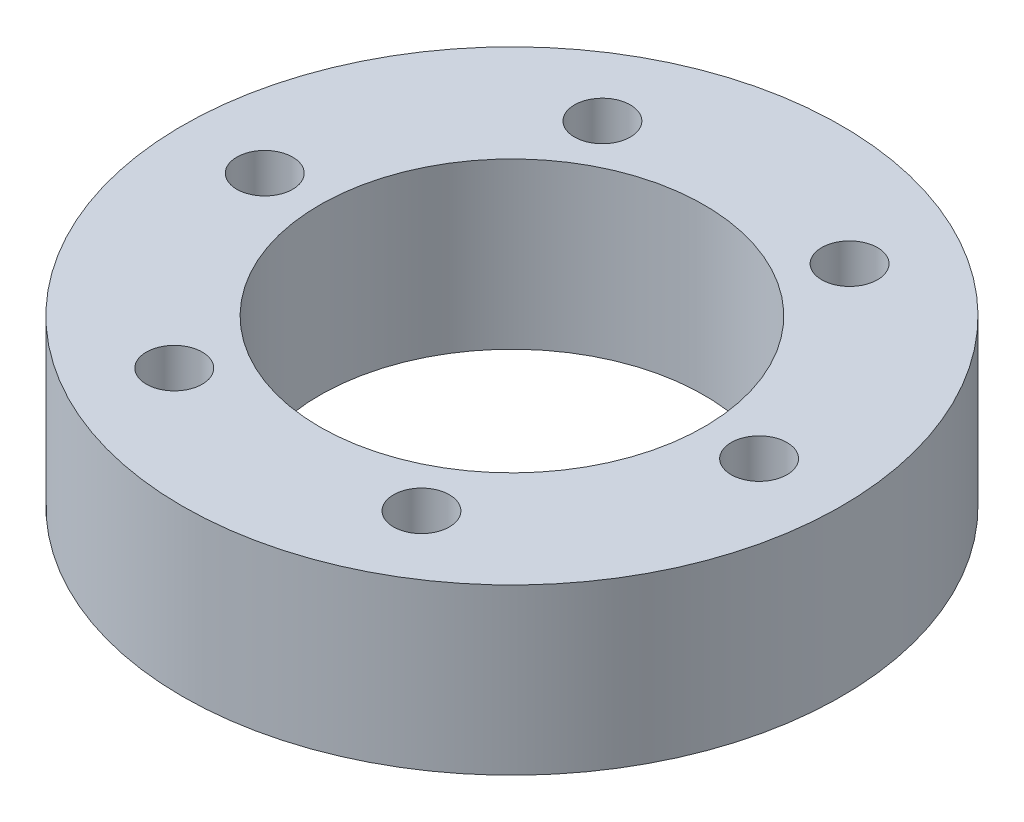
ISO-10303-21;
HEADER;
FILE_DESCRIPTION(('STEP AP214'),'2;1');
FILE_NAME('part.step','',(''),(''),'','','');
FILE_SCHEMA(('AUTOMOTIVE_DESIGN { 1 0 10303 214 1 1 1 1 }'));
ENDSEC;
DATA;
#1=APPLICATION_CONTEXT('core data for automotive mechanical design processes');
#2=APPLICATION_PROTOCOL_DEFINITION('international standard','automotive_design',2000,#1);
#3=PRODUCT_CONTEXT('',#1,'mechanical');
#4=PRODUCT('Part','Part','',(#3));
#5=PRODUCT_RELATED_PRODUCT_CATEGORY('part','',(#4));
#6=PRODUCT_DEFINITION_FORMATION('','',#4);
#7=PRODUCT_DEFINITION_CONTEXT('part definition',#1,'design');
#8=PRODUCT_DEFINITION('design','',#6,#7);
#9=PRODUCT_DEFINITION_SHAPE('','',#8);
#10=(LENGTH_UNIT() NAMED_UNIT(*) SI_UNIT(.MILLI.,.METRE.));
#11=(NAMED_UNIT(*) PLANE_ANGLE_UNIT() SI_UNIT($,.RADIAN.));
#12=(NAMED_UNIT(*) SI_UNIT($,.STERADIAN.) SOLID_ANGLE_UNIT());
#13=UNCERTAINTY_MEASURE_WITH_UNIT(LENGTH_MEASURE(1.E-05),#10,'distance_accuracy_value','');
#14=(GEOMETRIC_REPRESENTATION_CONTEXT(3) GLOBAL_UNCERTAINTY_ASSIGNED_CONTEXT((#13)) GLOBAL_UNIT_ASSIGNED_CONTEXT((#10,
#11,#12)) REPRESENTATION_CONTEXT('',''));
#15=CARTESIAN_POINT('',(0.,0.,0.));
#16=DIRECTION('',(0.,0.,1.));
#17=DIRECTION('',(1.,0.,0.));
#18=AXIS2_PLACEMENT_3D('',#15,#16,#17);
#19=CARTESIAN_POINT('',(0.,9.,0.));
#20=DIRECTION('',(0.,-1.,0.));
#21=DIRECTION('',(0.,0.,-1.));
#22=AXIS2_PLACEMENT_3D('',#19,#20,#21);
#23=CYLINDRICAL_SURFACE('',#22,18.);
#24=CARTESIAN_POINT('',(0.,9.,0.));
#25=DIRECTION('',(0.,1.,0.));
#26=DIRECTION('',(0.,0.,1.));
#27=AXIS2_PLACEMENT_3D('',#24,#25,#26);
#28=CIRCLE('',#27,18.);
#29=CARTESIAN_POINT('',(0.,9.,18.));
#30=VERTEX_POINT('',#29);
#31=EDGE_CURVE('E10',#30,#30,#28,.T.);
#32=ORIENTED_EDGE('',*,*,#31,.F.);
#33=EDGE_LOOP('',(#32));
#34=FACE_BOUND('',#33,.T.);
#35=CARTESIAN_POINT('',(0.,0.,0.));
#36=DIRECTION('',(0.,1.,0.));
#37=DIRECTION('',(0.,0.,1.));
#38=AXIS2_PLACEMENT_3D('',#35,#36,#37);
#39=CIRCLE('',#38,18.);
#40=CARTESIAN_POINT('',(0.,0.,18.));
#41=VERTEX_POINT('',#40);
#42=EDGE_CURVE('E43',#41,#41,#39,.T.);
#43=ORIENTED_EDGE('',*,*,#42,.T.);
#44=EDGE_LOOP('',(#43));
#45=FACE_BOUND('',#44,.T.);
#46=ADVANCED_FACE('F40',(#34,#45),#23,.T.);
#47=CARTESIAN_POINT('',(0.,9.,0.));
#48=DIRECTION('',(0.,1.,0.));
#49=DIRECTION('',(0.,0.,1.));
#50=AXIS2_PLACEMENT_3D('',#47,#48,#49);
#51=PLANE('',#50);
#52=CARTESIAN_POINT('',(0.,9.,0.));
#53=DIRECTION('',(0.,1.,0.));
#54=DIRECTION('',(0.,0.,1.));
#55=AXIS2_PLACEMENT_3D('',#52,#53,#54);
#56=CIRCLE('',#55,10.5);
#57=CARTESIAN_POINT('',(0.,9.,10.5));
#58=VERTEX_POINT('',#57);
#59=EDGE_CURVE('E102',#58,#58,#56,.T.);
#60=ORIENTED_EDGE('',*,*,#59,.F.);
#61=EDGE_LOOP('',(#60));
#62=FACE_BOUND('',#61,.T.);
#63=CARTESIAN_POINT('',(13.5,9.,0.));
#64=DIRECTION('',(0.,1.,0.));
#65=DIRECTION('',(0.,0.,1.));
#66=AXIS2_PLACEMENT_3D('',#63,#64,#65);
#67=CIRCLE('',#66,1.525);
#68=CARTESIAN_POINT('',(13.5,9.,1.525));
#69=VERTEX_POINT('',#68);
#70=EDGE_CURVE('E87',#69,#69,#67,.T.);
#71=ORIENTED_EDGE('',*,*,#70,.F.);
#72=EDGE_LOOP('',(#71));
#73=FACE_BOUND('',#72,.T.);
#74=CARTESIAN_POINT('',(6.75,9.,-11.6913429510899));
#75=DIRECTION('',(0.,1.,0.));
#76=DIRECTION('',(0.,0.,1.));
#77=AXIS2_PLACEMENT_3D('',#74,#75,#76);
#78=CIRCLE('',#77,1.525);
#79=CARTESIAN_POINT('',(6.75,9.,-10.1663429510899));
#80=VERTEX_POINT('',#79);
#81=EDGE_CURVE('E59',#80,#80,#78,.T.);
#82=ORIENTED_EDGE('',*,*,#81,.F.);
#83=EDGE_LOOP('',(#82));
#84=FACE_BOUND('',#83,.T.);
#85=CARTESIAN_POINT('',(-6.75000000000001,9.,-11.6913429510899));
#86=DIRECTION('',(0.,1.,0.));
#87=DIRECTION('',(0.,0.,1.));
#88=AXIS2_PLACEMENT_3D('',#85,#86,#87);
#89=CIRCLE('',#88,1.525);
#90=CARTESIAN_POINT('',(-6.75000000000001,9.,-10.1663429510899));
#91=VERTEX_POINT('',#90);
#92=EDGE_CURVE('E58',#91,#91,#89,.T.);
#93=ORIENTED_EDGE('',*,*,#92,.F.);
#94=EDGE_LOOP('',(#93));
#95=FACE_BOUND('',#94,.T.);
#96=CARTESIAN_POINT('',(-13.5,9.,0.));
#97=DIRECTION('',(0.,1.,0.));
#98=DIRECTION('',(0.,0.,1.));
#99=AXIS2_PLACEMENT_3D('',#96,#97,#98);
#100=CIRCLE('',#99,1.525);
#101=CARTESIAN_POINT('',(-13.5,9.,1.525));
#102=VERTEX_POINT('',#101);
#103=EDGE_CURVE('E67',#102,#102,#100,.T.);
#104=ORIENTED_EDGE('',*,*,#103,.F.);
#105=EDGE_LOOP('',(#104));
#106=FACE_BOUND('',#105,.T.);
#107=CARTESIAN_POINT('',(-6.75,9.,11.6913429510899));
#108=DIRECTION('',(0.,1.,0.));
#109=DIRECTION('',(0.,0.,1.));
#110=AXIS2_PLACEMENT_3D('',#107,#108,#109);
#111=CIRCLE('',#110,1.525);
#112=CARTESIAN_POINT('',(-6.75,9.,13.2163429510899));
#113=VERTEX_POINT('',#112);
#114=EDGE_CURVE('E75',#113,#113,#111,.T.);
#115=ORIENTED_EDGE('',*,*,#114,.F.);
#116=EDGE_LOOP('',(#115));
#117=FACE_BOUND('',#116,.T.);
#118=CARTESIAN_POINT('',(6.75,9.,11.6913429510899));
#119=DIRECTION('',(0.,1.,0.));
#120=DIRECTION('',(0.,0.,1.));
#121=AXIS2_PLACEMENT_3D('',#118,#119,#120);
#122=CIRCLE('',#121,1.525);
#123=CARTESIAN_POINT('',(6.75,9.,13.2163429510899));
#124=VERTEX_POINT('',#123);
#125=EDGE_CURVE('E83',#124,#124,#122,.T.);
#126=ORIENTED_EDGE('',*,*,#125,.F.);
#127=EDGE_LOOP('',(#126));
#128=FACE_BOUND('',#127,.T.);
#129=ORIENTED_EDGE('',*,*,#31,.T.);
#130=EDGE_LOOP('',(#129));
#131=FACE_BOUND('',#130,.T.);
#132=ADVANCED_FACE('F120',(#62,#73,#84,#95,#106,#117,#128,#131),#51,.T.);
#133=CARTESIAN_POINT('',(0.,0.,0.));
#134=DIRECTION('',(0.,1.,0.));
#135=DIRECTION('',(0.,0.,1.));
#136=AXIS2_PLACEMENT_3D('',#133,#134,#135);
#137=PLANE('',#136);
#138=CARTESIAN_POINT('',(0.,0.,0.));
#139=DIRECTION('',(0.,1.,0.));
#140=DIRECTION('',(0.,0.,1.));
#141=AXIS2_PLACEMENT_3D('',#138,#139,#140);
#142=CIRCLE('',#141,10.5);
#143=CARTESIAN_POINT('',(0.,0.,10.5));
#144=VERTEX_POINT('',#143);
#145=EDGE_CURVE('E92',#144,#144,#142,.T.);
#146=ORIENTED_EDGE('',*,*,#145,.T.);
#147=EDGE_LOOP('',(#146));
#148=FACE_BOUND('',#147,.T.);
#149=CARTESIAN_POINT('',(13.5,0.,0.));
#150=DIRECTION('',(0.,1.,0.));
#151=DIRECTION('',(0.,0.,1.));
#152=AXIS2_PLACEMENT_3D('',#149,#150,#151);
#153=CIRCLE('',#152,1.525);
#154=CARTESIAN_POINT('',(13.5,0.,1.525));
#155=VERTEX_POINT('',#154);
#156=EDGE_CURVE('E52',#155,#155,#153,.T.);
#157=ORIENTED_EDGE('',*,*,#156,.T.);
#158=EDGE_LOOP('',(#157));
#159=FACE_BOUND('',#158,.T.);
#160=CARTESIAN_POINT('',(6.75,0.,-11.6913429510899));
#161=DIRECTION('',(0.,1.,0.));
#162=DIRECTION('',(0.,0.,1.));
#163=AXIS2_PLACEMENT_3D('',#160,#161,#162);
#164=CIRCLE('',#163,1.525);
#165=CARTESIAN_POINT('',(6.75,0.,-10.1663429510899));
#166=VERTEX_POINT('',#165);
#167=EDGE_CURVE('E88',#166,#166,#164,.T.);
#168=ORIENTED_EDGE('',*,*,#167,.T.);
#169=EDGE_LOOP('',(#168));
#170=FACE_BOUND('',#169,.T.);
#171=CARTESIAN_POINT('',(-6.75000000000001,0.,-11.6913429510899));
#172=DIRECTION('',(0.,1.,0.));
#173=DIRECTION('',(0.,0.,1.));
#174=AXIS2_PLACEMENT_3D('',#171,#172,#173);
#175=CIRCLE('',#174,1.525);
#176=CARTESIAN_POINT('',(-6.75000000000001,0.,-10.1663429510899));
#177=VERTEX_POINT('',#176);
#178=EDGE_CURVE('E54',#177,#177,#175,.T.);
#179=ORIENTED_EDGE('',*,*,#178,.T.);
#180=EDGE_LOOP('',(#179));
#181=FACE_BOUND('',#180,.T.);
#182=CARTESIAN_POINT('',(-13.5,0.,0.));
#183=DIRECTION('',(0.,1.,0.));
#184=DIRECTION('',(0.,0.,1.));
#185=AXIS2_PLACEMENT_3D('',#182,#183,#184);
#186=CIRCLE('',#185,1.525);
#187=CARTESIAN_POINT('',(-13.5,0.,1.525));
#188=VERTEX_POINT('',#187);
#189=EDGE_CURVE('E63',#188,#188,#186,.T.);
#190=ORIENTED_EDGE('',*,*,#189,.T.);
#191=EDGE_LOOP('',(#190));
#192=FACE_BOUND('',#191,.T.);
#193=CARTESIAN_POINT('',(-6.75,0.,11.6913429510899));
#194=DIRECTION('',(0.,1.,0.));
#195=DIRECTION('',(0.,0.,1.));
#196=AXIS2_PLACEMENT_3D('',#193,#194,#195);
#197=CIRCLE('',#196,1.525);
#198=CARTESIAN_POINT('',(-6.75,0.,13.2163429510899));
#199=VERTEX_POINT('',#198);
#200=EDGE_CURVE('E71',#199,#199,#197,.T.);
#201=ORIENTED_EDGE('',*,*,#200,.T.);
#202=EDGE_LOOP('',(#201));
#203=FACE_BOUND('',#202,.T.);
#204=CARTESIAN_POINT('',(6.75,0.,11.6913429510899));
#205=DIRECTION('',(0.,1.,0.));
#206=DIRECTION('',(0.,0.,1.));
#207=AXIS2_PLACEMENT_3D('',#204,#205,#206);
#208=CIRCLE('',#207,1.525);
#209=CARTESIAN_POINT('',(6.75,0.,13.2163429510899));
#210=VERTEX_POINT('',#209);
#211=EDGE_CURVE('E79',#210,#210,#208,.T.);
#212=ORIENTED_EDGE('',*,*,#211,.T.);
#213=EDGE_LOOP('',(#212));
#214=FACE_BOUND('',#213,.T.);
#215=ORIENTED_EDGE('',*,*,#42,.F.);
#216=EDGE_LOOP('',(#215));
#217=FACE_BOUND('',#216,.T.);
#218=ADVANCED_FACE('F110',(#148,#159,#170,#181,#192,#203,#214,#217),#137,.F.);
#219=CARTESIAN_POINT('',(6.75,0.,11.6913429510899));
#220=DIRECTION('',(0.,1.,0.));
#221=DIRECTION('',(0.,0.,1.));
#222=AXIS2_PLACEMENT_3D('',#219,#220,#221);
#223=CYLINDRICAL_SURFACE('',#222,1.525);
#224=ORIENTED_EDGE('',*,*,#211,.F.);
#225=EDGE_LOOP('',(#224));
#226=FACE_BOUND('',#225,.T.);
#227=ORIENTED_EDGE('',*,*,#125,.T.);
#228=EDGE_LOOP('',(#227));
#229=FACE_BOUND('',#228,.T.);
#230=ADVANCED_FACE('F136',(#226,#229),#223,.F.);
#231=CARTESIAN_POINT('',(-6.75,0.,11.6913429510899));
#232=DIRECTION('',(0.,1.,0.));
#233=DIRECTION('',(0.,0.,1.));
#234=AXIS2_PLACEMENT_3D('',#231,#232,#233);
#235=CYLINDRICAL_SURFACE('',#234,1.525);
#236=ORIENTED_EDGE('',*,*,#200,.F.);
#237=EDGE_LOOP('',(#236));
#238=FACE_BOUND('',#237,.T.);
#239=ORIENTED_EDGE('',*,*,#114,.T.);
#240=EDGE_LOOP('',(#239));
#241=FACE_BOUND('',#240,.T.);
#242=ADVANCED_FACE('F138',(#238,#241),#235,.F.);
#243=CARTESIAN_POINT('',(-13.5,0.,0.));
#244=DIRECTION('',(0.,1.,0.));
#245=DIRECTION('',(0.,0.,1.));
#246=AXIS2_PLACEMENT_3D('',#243,#244,#245);
#247=CYLINDRICAL_SURFACE('',#246,1.525);
#248=ORIENTED_EDGE('',*,*,#189,.F.);
#249=EDGE_LOOP('',(#248));
#250=FACE_BOUND('',#249,.T.);
#251=ORIENTED_EDGE('',*,*,#103,.T.);
#252=EDGE_LOOP('',(#251));
#253=FACE_BOUND('',#252,.T.);
#254=ADVANCED_FACE('F145',(#250,#253),#247,.F.);
#255=CARTESIAN_POINT('',(-6.75000000000001,0.,-11.6913429510899));
#256=DIRECTION('',(0.,1.,0.));
#257=DIRECTION('',(0.,0.,1.));
#258=AXIS2_PLACEMENT_3D('',#255,#256,#257);
#259=CYLINDRICAL_SURFACE('',#258,1.525);
#260=ORIENTED_EDGE('',*,*,#178,.F.);
#261=EDGE_LOOP('',(#260));
#262=FACE_BOUND('',#261,.T.);
#263=ORIENTED_EDGE('',*,*,#92,.T.);
#264=EDGE_LOOP('',(#263));
#265=FACE_BOUND('',#264,.T.);
#266=ADVANCED_FACE('F193',(#262,#265),#259,.F.);
#267=CARTESIAN_POINT('',(6.75,0.,-11.6913429510899));
#268=DIRECTION('',(0.,1.,0.));
#269=DIRECTION('',(0.,0.,1.));
#270=AXIS2_PLACEMENT_3D('',#267,#268,#269);
#271=CYLINDRICAL_SURFACE('',#270,1.525);
#272=ORIENTED_EDGE('',*,*,#167,.F.);
#273=EDGE_LOOP('',(#272));
#274=FACE_BOUND('',#273,.T.);
#275=ORIENTED_EDGE('',*,*,#81,.T.);
#276=EDGE_LOOP('',(#275));
#277=FACE_BOUND('',#276,.T.);
#278=ADVANCED_FACE('F186',(#274,#277),#271,.F.);
#279=CARTESIAN_POINT('',(13.5,0.,0.));
#280=DIRECTION('',(0.,1.,0.));
#281=DIRECTION('',(0.,0.,1.));
#282=AXIS2_PLACEMENT_3D('',#279,#280,#281);
#283=CYLINDRICAL_SURFACE('',#282,1.525);
#284=ORIENTED_EDGE('',*,*,#156,.F.);
#285=EDGE_LOOP('',(#284));
#286=FACE_BOUND('',#285,.T.);
#287=ORIENTED_EDGE('',*,*,#70,.T.);
#288=EDGE_LOOP('',(#287));
#289=FACE_BOUND('',#288,.T.);
#290=ADVANCED_FACE('F116',(#286,#289),#283,.F.);
#291=CARTESIAN_POINT('',(0.,0.,0.));
#292=DIRECTION('',(0.,1.,0.));
#293=DIRECTION('',(0.,0.,1.));
#294=AXIS2_PLACEMENT_3D('',#291,#292,#293);
#295=CYLINDRICAL_SURFACE('',#294,10.5);
#296=ORIENTED_EDGE('',*,*,#145,.F.);
#297=EDGE_LOOP('',(#296));
#298=FACE_BOUND('',#297,.T.);
#299=ORIENTED_EDGE('',*,*,#59,.T.);
#300=EDGE_LOOP('',(#299));
#301=FACE_BOUND('',#300,.T.);
#302=ADVANCED_FACE('F113',(#298,#301),#295,.F.);
#303=CLOSED_SHELL('',(#46,#132,#218,#230,#242,#254,#266,#278,#290,#302));
#304=MANIFOLD_SOLID_BREP('B2',#303);
#305=ADVANCED_BREP_SHAPE_REPRESENTATION('',(#18,#304),#14);
#306=SHAPE_DEFINITION_REPRESENTATION(#9,#305);
ENDSEC;
END-ISO-10303-21;
